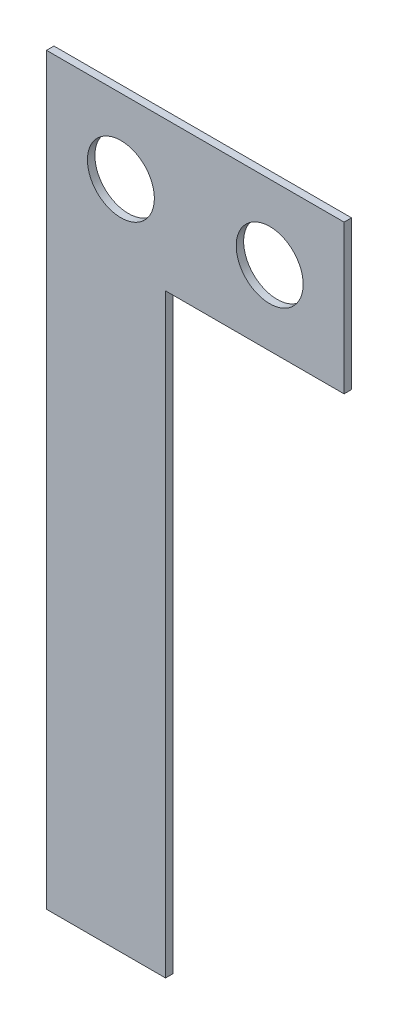
ISO-10303-21;
HEADER;
FILE_DESCRIPTION(('STEP AP214'),'2;1');
FILE_NAME('part.step','',(''),(''),'','','');
FILE_SCHEMA(('AUTOMOTIVE_DESIGN { 1 0 10303 214 1 1 1 1 }'));
ENDSEC;
DATA;
#1=APPLICATION_CONTEXT('core data for automotive mechanical design processes');
#2=APPLICATION_PROTOCOL_DEFINITION('international standard','automotive_design',2000,#1);
#3=PRODUCT_CONTEXT('',#1,'mechanical');
#4=PRODUCT('Part','Part','',(#3));
#5=PRODUCT_RELATED_PRODUCT_CATEGORY('part','',(#4));
#6=PRODUCT_DEFINITION_FORMATION('','',#4);
#7=PRODUCT_DEFINITION_CONTEXT('part definition',#1,'design');
#8=PRODUCT_DEFINITION('design','',#6,#7);
#9=PRODUCT_DEFINITION_SHAPE('','',#8);
#10=(LENGTH_UNIT() NAMED_UNIT(*) SI_UNIT(.MILLI.,.METRE.));
#11=(NAMED_UNIT(*) PLANE_ANGLE_UNIT() SI_UNIT($,.RADIAN.));
#12=(NAMED_UNIT(*) SI_UNIT($,.STERADIAN.) SOLID_ANGLE_UNIT());
#13=UNCERTAINTY_MEASURE_WITH_UNIT(LENGTH_MEASURE(1.E-05),#10,'distance_accuracy_value','');
#14=(GEOMETRIC_REPRESENTATION_CONTEXT(3) GLOBAL_UNCERTAINTY_ASSIGNED_CONTEXT((#13)) GLOBAL_UNIT_ASSIGNED_CONTEXT((#10,
#11,#12)) REPRESENTATION_CONTEXT('',''));
#15=CARTESIAN_POINT('',(0.,0.,0.));
#16=DIRECTION('',(0.,0.,1.));
#17=DIRECTION('',(1.,0.,0.));
#18=AXIS2_PLACEMENT_3D('',#15,#16,#17);
#19=CARTESIAN_POINT('',(0.,0.,0.5));
#20=DIRECTION('',(0.,0.,1.));
#21=DIRECTION('',(1.,0.,0.));
#22=AXIS2_PLACEMENT_3D('',#19,#20,#21);
#23=PLANE('',#22);
#24=CARTESIAN_POINT('',(5.,-5.,0.5));
#25=DIRECTION('',(0.,0.,1.));
#26=DIRECTION('',(1.,0.,0.));
#27=AXIS2_PLACEMENT_3D('',#24,#25,#26);
#28=CIRCLE('',#27,2.25);
#29=CARTESIAN_POINT('',(7.25,-5.,0.5));
#30=VERTEX_POINT('',#29);
#31=EDGE_CURVE('E192',#30,#30,#28,.T.);
#32=ORIENTED_EDGE('',*,*,#31,.F.);
#33=EDGE_LOOP('',(#32));
#34=FACE_BOUND('',#33,.T.);
#35=CARTESIAN_POINT('',(15.,-5.,0.5));
#36=DIRECTION('',(0.,0.,1.));
#37=DIRECTION('',(1.,0.,0.));
#38=AXIS2_PLACEMENT_3D('',#35,#36,#37);
#39=CIRCLE('',#38,2.25);
#40=CARTESIAN_POINT('',(17.25,-5.,0.5));
#41=VERTEX_POINT('',#40);
#42=EDGE_CURVE('E196',#41,#41,#39,.T.);
#43=ORIENTED_EDGE('',*,*,#42,.F.);
#44=EDGE_LOOP('',(#43));
#45=FACE_BOUND('',#44,.T.);
#46=DIRECTION('',(-1.,0.,0.));
#47=VECTOR('',#46,1.);
#48=CARTESIAN_POINT('',(20.,0.,0.5));
#49=LINE('',#48,#47);
#50=CARTESIAN_POINT('',(20.,0.,0.5));
#51=VERTEX_POINT('',#50);
#52=CARTESIAN_POINT('',(0.,0.,0.5));
#53=VERTEX_POINT('',#52);
#54=EDGE_CURVE('E150',#51,#53,#49,.T.);
#55=ORIENTED_EDGE('',*,*,#54,.T.);
#56=DIRECTION('',(0.,-1.,0.));
#57=VECTOR('',#56,1.);
#58=CARTESIAN_POINT('',(0.,0.,0.5));
#59=LINE('',#58,#57);
#60=CARTESIAN_POINT('',(0.,-50.,0.5));
#61=VERTEX_POINT('',#60);
#62=EDGE_CURVE('E99',#53,#61,#59,.T.);
#63=ORIENTED_EDGE('',*,*,#62,.T.);
#64=DIRECTION('',(1.,0.,0.));
#65=VECTOR('',#64,1.);
#66=CARTESIAN_POINT('',(0.,-50.,0.5));
#67=LINE('',#66,#65);
#68=CARTESIAN_POINT('',(8.00000000000001,-50.,0.5));
#69=VERTEX_POINT('',#68);
#70=EDGE_CURVE('E111',#61,#69,#67,.T.);
#71=ORIENTED_EDGE('',*,*,#70,.T.);
#72=DIRECTION('',(0.,1.,0.));
#73=VECTOR('',#72,1.);
#74=CARTESIAN_POINT('',(8.00000000000001,-50.,0.5));
#75=LINE('',#74,#73);
#76=CARTESIAN_POINT('',(8.00000000000001,-10.,0.5));
#77=VERTEX_POINT('',#76);
#78=EDGE_CURVE('E106',#69,#77,#75,.T.);
#79=ORIENTED_EDGE('',*,*,#78,.T.);
#80=DIRECTION('',(1.,0.,0.));
#81=VECTOR('',#80,1.);
#82=CARTESIAN_POINT('',(8.00000000000001,-10.,0.5));
#83=LINE('',#82,#81);
#84=CARTESIAN_POINT('',(20.,-10.,0.5));
#85=VERTEX_POINT('',#84);
#86=EDGE_CURVE('E109',#77,#85,#83,.T.);
#87=ORIENTED_EDGE('',*,*,#86,.T.);
#88=DIRECTION('',(0.,1.,0.));
#89=VECTOR('',#88,1.);
#90=CARTESIAN_POINT('',(20.,-10.,0.5));
#91=LINE('',#90,#89);
#92=EDGE_CURVE('E59',#85,#51,#91,.T.);
#93=ORIENTED_EDGE('',*,*,#92,.T.);
#94=EDGE_LOOP('',(#55,#63,#71,#79,#87,#93));
#95=FACE_BOUND('',#94,.T.);
#96=ADVANCED_FACE('F39',(#34,#45,#95),#23,.T.);
#97=CARTESIAN_POINT('',(0.,0.,0.));
#98=DIRECTION('',(0.,0.,1.));
#99=DIRECTION('',(1.,0.,0.));
#100=AXIS2_PLACEMENT_3D('',#97,#98,#99);
#101=PLANE('',#100);
#102=CARTESIAN_POINT('',(5.,-5.,0.));
#103=DIRECTION('',(0.,0.,1.));
#104=DIRECTION('',(1.,0.,0.));
#105=AXIS2_PLACEMENT_3D('',#102,#103,#104);
#106=CIRCLE('',#105,2.25);
#107=CARTESIAN_POINT('',(7.25,-5.,0.));
#108=VERTEX_POINT('',#107);
#109=EDGE_CURVE('E195',#108,#108,#106,.T.);
#110=ORIENTED_EDGE('',*,*,#109,.T.);
#111=EDGE_LOOP('',(#110));
#112=FACE_BOUND('',#111,.T.);
#113=CARTESIAN_POINT('',(15.,-5.,0.));
#114=DIRECTION('',(0.,0.,1.));
#115=DIRECTION('',(1.,0.,0.));
#116=AXIS2_PLACEMENT_3D('',#113,#114,#115);
#117=CIRCLE('',#116,2.25);
#118=CARTESIAN_POINT('',(17.25,-5.,0.));
#119=VERTEX_POINT('',#118);
#120=EDGE_CURVE('E140',#119,#119,#117,.T.);
#121=ORIENTED_EDGE('',*,*,#120,.T.);
#122=EDGE_LOOP('',(#121));
#123=FACE_BOUND('',#122,.T.);
#124=DIRECTION('',(-1.,0.,0.));
#125=VECTOR('',#124,1.);
#126=CARTESIAN_POINT('',(20.,0.,0.));
#127=LINE('',#126,#125);
#128=CARTESIAN_POINT('',(20.,0.,0.));
#129=VERTEX_POINT('',#128);
#130=CARTESIAN_POINT('',(0.,0.,0.));
#131=VERTEX_POINT('',#130);
#132=EDGE_CURVE('E135',#129,#131,#127,.T.);
#133=ORIENTED_EDGE('',*,*,#132,.F.);
#134=DIRECTION('',(0.,1.,0.));
#135=VECTOR('',#134,1.);
#136=CARTESIAN_POINT('',(20.,-10.,0.));
#137=LINE('',#136,#135);
#138=CARTESIAN_POINT('',(20.,-10.,0.));
#139=VERTEX_POINT('',#138);
#140=EDGE_CURVE('E91',#139,#129,#137,.T.);
#141=ORIENTED_EDGE('',*,*,#140,.F.);
#142=DIRECTION('',(1.,0.,0.));
#143=VECTOR('',#142,1.);
#144=CARTESIAN_POINT('',(8.00000000000001,-10.,0.));
#145=LINE('',#144,#143);
#146=CARTESIAN_POINT('',(8.00000000000001,-10.,0.));
#147=VERTEX_POINT('',#146);
#148=EDGE_CURVE('E84',#147,#139,#145,.T.);
#149=ORIENTED_EDGE('',*,*,#148,.F.);
#150=DIRECTION('',(0.,1.,0.));
#151=VECTOR('',#150,1.);
#152=CARTESIAN_POINT('',(8.00000000000001,-50.,0.));
#153=LINE('',#152,#151);
#154=CARTESIAN_POINT('',(8.00000000000001,-50.,0.));
#155=VERTEX_POINT('',#154);
#156=EDGE_CURVE('E120',#155,#147,#153,.T.);
#157=ORIENTED_EDGE('',*,*,#156,.F.);
#158=DIRECTION('',(1.,0.,0.));
#159=VECTOR('',#158,1.);
#160=CARTESIAN_POINT('',(0.,-50.,0.));
#161=LINE('',#160,#159);
#162=CARTESIAN_POINT('',(0.,-50.,0.));
#163=VERTEX_POINT('',#162);
#164=EDGE_CURVE('E142',#163,#155,#161,.T.);
#165=ORIENTED_EDGE('',*,*,#164,.F.);
#166=DIRECTION('',(0.,-1.,0.));
#167=VECTOR('',#166,1.);
#168=CARTESIAN_POINT('',(0.,0.,0.));
#169=LINE('',#168,#167);
#170=EDGE_CURVE('E139',#131,#163,#169,.T.);
#171=ORIENTED_EDGE('',*,*,#170,.F.);
#172=EDGE_LOOP('',(#133,#141,#149,#157,#165,#171));
#173=FACE_BOUND('',#172,.T.);
#174=ADVANCED_FACE('F160',(#112,#123,#173),#101,.F.);
#175=CARTESIAN_POINT('',(20.,0.,0.5));
#176=DIRECTION('',(0.,-1.,0.));
#177=DIRECTION('',(1.,0.,0.));
#178=AXIS2_PLACEMENT_3D('',#175,#176,#177);
#179=PLANE('',#178);
#180=ORIENTED_EDGE('',*,*,#132,.T.);
#181=DIRECTION('',(0.,0.,-1.));
#182=VECTOR('',#181,1.);
#183=CARTESIAN_POINT('',(0.,0.,0.5));
#184=LINE('',#183,#182);
#185=EDGE_CURVE('E11',#53,#131,#184,.T.);
#186=ORIENTED_EDGE('',*,*,#185,.F.);
#187=ORIENTED_EDGE('',*,*,#54,.F.);
#188=DIRECTION('',(0.,0.,-1.));
#189=VECTOR('',#188,1.);
#190=CARTESIAN_POINT('',(20.,0.,0.5));
#191=LINE('',#190,#189);
#192=EDGE_CURVE('E131',#51,#129,#191,.T.);
#193=ORIENTED_EDGE('',*,*,#192,.T.);
#194=EDGE_LOOP('',(#180,#186,#187,#193));
#195=FACE_BOUND('',#194,.T.);
#196=ADVANCED_FACE('F41',(#195),#179,.F.);
#197=CARTESIAN_POINT('',(0.,0.,0.5));
#198=DIRECTION('',(1.,0.,0.));
#199=DIRECTION('',(0.,1.,0.));
#200=AXIS2_PLACEMENT_3D('',#197,#198,#199);
#201=PLANE('',#200);
#202=ORIENTED_EDGE('',*,*,#170,.T.);
#203=DIRECTION('',(0.,0.,-1.));
#204=VECTOR('',#203,1.);
#205=CARTESIAN_POINT('',(0.,-50.,0.5));
#206=LINE('',#205,#204);
#207=EDGE_CURVE('E48',#61,#163,#206,.T.);
#208=ORIENTED_EDGE('',*,*,#207,.F.);
#209=ORIENTED_EDGE('',*,*,#62,.F.);
#210=ORIENTED_EDGE('',*,*,#185,.T.);
#211=EDGE_LOOP('',(#202,#208,#209,#210));
#212=FACE_BOUND('',#211,.T.);
#213=ADVANCED_FACE('F252',(#212),#201,.F.);
#214=CARTESIAN_POINT('',(0.,-50.,0.5));
#215=DIRECTION('',(0.,1.,0.));
#216=DIRECTION('',(0.,0.,1.));
#217=AXIS2_PLACEMENT_3D('',#214,#215,#216);
#218=PLANE('',#217);
#219=ORIENTED_EDGE('',*,*,#164,.T.);
#220=DIRECTION('',(0.,0.,-1.));
#221=VECTOR('',#220,1.);
#222=CARTESIAN_POINT('',(8.00000000000001,-50.,0.5));
#223=LINE('',#222,#221);
#224=EDGE_CURVE('E122',#69,#155,#223,.T.);
#225=ORIENTED_EDGE('',*,*,#224,.F.);
#226=ORIENTED_EDGE('',*,*,#70,.F.);
#227=ORIENTED_EDGE('',*,*,#207,.T.);
#228=EDGE_LOOP('',(#219,#225,#226,#227));
#229=FACE_BOUND('',#228,.T.);
#230=ADVANCED_FACE('F157',(#229),#218,.F.);
#231=CARTESIAN_POINT('',(8.00000000000001,-50.,0.5));
#232=DIRECTION('',(-1.,0.,0.));
#233=DIRECTION('',(0.,-1.,0.));
#234=AXIS2_PLACEMENT_3D('',#231,#232,#233);
#235=PLANE('',#234);
#236=ORIENTED_EDGE('',*,*,#156,.T.);
#237=DIRECTION('',(0.,0.,-1.));
#238=VECTOR('',#237,1.);
#239=CARTESIAN_POINT('',(8.00000000000001,-10.,0.5));
#240=LINE('',#239,#238);
#241=EDGE_CURVE('E117',#77,#147,#240,.T.);
#242=ORIENTED_EDGE('',*,*,#241,.F.);
#243=ORIENTED_EDGE('',*,*,#78,.F.);
#244=ORIENTED_EDGE('',*,*,#224,.T.);
#245=EDGE_LOOP('',(#236,#242,#243,#244));
#246=FACE_BOUND('',#245,.T.);
#247=ADVANCED_FACE('F118',(#246),#235,.F.);
#248=CARTESIAN_POINT('',(8.00000000000001,-10.,0.5));
#249=DIRECTION('',(0.,1.,0.));
#250=DIRECTION('',(-1.,0.,0.));
#251=AXIS2_PLACEMENT_3D('',#248,#249,#250);
#252=PLANE('',#251);
#253=ORIENTED_EDGE('',*,*,#148,.T.);
#254=DIRECTION('',(0.,0.,-1.));
#255=VECTOR('',#254,1.);
#256=CARTESIAN_POINT('',(20.,-10.,0.5));
#257=LINE('',#256,#255);
#258=EDGE_CURVE('E123',#85,#139,#257,.T.);
#259=ORIENTED_EDGE('',*,*,#258,.F.);
#260=ORIENTED_EDGE('',*,*,#86,.F.);
#261=ORIENTED_EDGE('',*,*,#241,.T.);
#262=EDGE_LOOP('',(#253,#259,#260,#261));
#263=FACE_BOUND('',#262,.T.);
#264=ADVANCED_FACE('F125',(#263),#252,.F.);
#265=CARTESIAN_POINT('',(20.,-10.,0.5));
#266=DIRECTION('',(-1.,0.,0.));
#267=DIRECTION('',(0.,0.,1.));
#268=AXIS2_PLACEMENT_3D('',#265,#266,#267);
#269=PLANE('',#268);
#270=ORIENTED_EDGE('',*,*,#140,.T.);
#271=ORIENTED_EDGE('',*,*,#192,.F.);
#272=ORIENTED_EDGE('',*,*,#92,.F.);
#273=ORIENTED_EDGE('',*,*,#258,.T.);
#274=EDGE_LOOP('',(#270,#271,#272,#273));
#275=FACE_BOUND('',#274,.T.);
#276=ADVANCED_FACE('F164',(#275),#269,.F.);
#277=CARTESIAN_POINT('',(15.,-5.,0.5));
#278=DIRECTION('',(0.,0.,1.));
#279=DIRECTION('',(1.,0.,0.));
#280=AXIS2_PLACEMENT_3D('',#277,#278,#279);
#281=CYLINDRICAL_SURFACE('',#280,2.25);
#282=ORIENTED_EDGE('',*,*,#42,.T.);
#283=EDGE_LOOP('',(#282));
#284=FACE_BOUND('',#283,.T.);
#285=ORIENTED_EDGE('',*,*,#120,.F.);
#286=EDGE_LOOP('',(#285));
#287=FACE_BOUND('',#286,.T.);
#288=ADVANCED_FACE('F166',(#284,#287),#281,.F.);
#289=CARTESIAN_POINT('',(5.,-5.,0.5));
#290=DIRECTION('',(0.,0.,1.));
#291=DIRECTION('',(1.,0.,0.));
#292=AXIS2_PLACEMENT_3D('',#289,#290,#291);
#293=CYLINDRICAL_SURFACE('',#292,2.25);
#294=ORIENTED_EDGE('',*,*,#31,.T.);
#295=EDGE_LOOP('',(#294));
#296=FACE_BOUND('',#295,.T.);
#297=ORIENTED_EDGE('',*,*,#109,.F.);
#298=EDGE_LOOP('',(#297));
#299=FACE_BOUND('',#298,.T.);
#300=ADVANCED_FACE('F172',(#296,#299),#293,.F.);
#301=CLOSED_SHELL('',(#96,#174,#196,#213,#230,#247,#264,#276,#288,#300));
#302=MANIFOLD_SOLID_BREP('B2',#301);
#303=ADVANCED_BREP_SHAPE_REPRESENTATION('',(#18,#302),#14);
#304=SHAPE_DEFINITION_REPRESENTATION(#9,#303);
ENDSEC;
END-ISO-10303-21;
